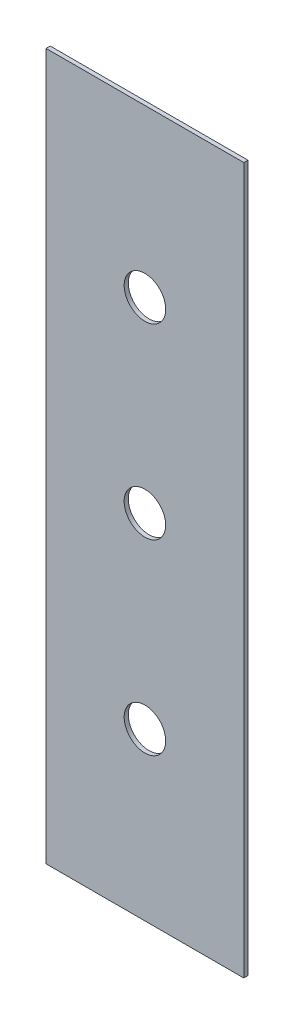
ISO-10303-21;
HEADER;
FILE_DESCRIPTION(('STEP AP214'),'2;1');
FILE_NAME('part.step','',(''),(''),'','','');
FILE_SCHEMA(('AUTOMOTIVE_DESIGN { 1 0 10303 214 1 1 1 1 }'));
ENDSEC;
DATA;
#1=APPLICATION_CONTEXT('core data for automotive mechanical design processes');
#2=APPLICATION_PROTOCOL_DEFINITION('international standard','automotive_design',2000,#1);
#3=PRODUCT_CONTEXT('',#1,'mechanical');
#4=PRODUCT('Part','Part','',(#3));
#5=PRODUCT_RELATED_PRODUCT_CATEGORY('part','',(#4));
#6=PRODUCT_DEFINITION_FORMATION('','',#4);
#7=PRODUCT_DEFINITION_CONTEXT('part definition',#1,'design');
#8=PRODUCT_DEFINITION('design','',#6,#7);
#9=PRODUCT_DEFINITION_SHAPE('','',#8);
#10=(LENGTH_UNIT() NAMED_UNIT(*) SI_UNIT(.MILLI.,.METRE.));
#11=(NAMED_UNIT(*) PLANE_ANGLE_UNIT() SI_UNIT($,.RADIAN.));
#12=(NAMED_UNIT(*) SI_UNIT($,.STERADIAN.) SOLID_ANGLE_UNIT());
#13=UNCERTAINTY_MEASURE_WITH_UNIT(LENGTH_MEASURE(1.E-05),#10,'distance_accuracy_value','');
#14=(GEOMETRIC_REPRESENTATION_CONTEXT(3) GLOBAL_UNCERTAINTY_ASSIGNED_CONTEXT((#13)) GLOBAL_UNIT_ASSIGNED_CONTEXT((#10,
#11,#12)) REPRESENTATION_CONTEXT('',''));
#15=CARTESIAN_POINT('',(0.,0.,0.));
#16=DIRECTION('',(0.,0.,1.));
#17=DIRECTION('',(1.,0.,0.));
#18=AXIS2_PLACEMENT_3D('',#15,#16,#17);
#19=CARTESIAN_POINT('',(0.,0.,1.));
#20=DIRECTION('',(0.,0.,-1.));
#21=DIRECTION('',(-1.,0.,0.));
#22=AXIS2_PLACEMENT_3D('',#19,#20,#21);
#23=PLANE('',#22);
#24=DIRECTION('',(0.,1.,0.));
#25=VECTOR('',#24,1.);
#26=CARTESIAN_POINT('',(299.637427607692,205.000000000005,1.));
#27=LINE('',#26,#25);
#28=CARTESIAN_POINT('',(299.637427607692,35.0000000000046,1.));
#29=VERTEX_POINT('',#28);
#30=CARTESIAN_POINT('',(299.637427607692,205.000000000005,1.));
#31=VERTEX_POINT('',#30);
#32=EDGE_CURVE('E89',#29,#31,#27,.T.);
#33=ORIENTED_EDGE('',*,*,#32,.T.);
#34=DIRECTION('',(-1.,0.,0.));
#35=VECTOR('',#34,1.);
#36=CARTESIAN_POINT('',(252.046776232743,205.000000000005,1.));
#37=LINE('',#36,#35);
#38=CARTESIAN_POINT('',(252.046776232743,205.000000000005,1.));
#39=VERTEX_POINT('',#38);
#40=EDGE_CURVE('E84',#31,#39,#37,.T.);
#41=ORIENTED_EDGE('',*,*,#40,.T.);
#42=DIRECTION('',(0.,-1.,0.));
#43=VECTOR('',#42,1.);
#44=CARTESIAN_POINT('',(252.046776232743,35.0000000000046,1.));
#45=LINE('',#44,#43);
#46=CARTESIAN_POINT('',(252.046776232743,35.0000000000046,1.));
#47=VERTEX_POINT('',#46);
#48=EDGE_CURVE('E87',#39,#47,#45,.T.);
#49=ORIENTED_EDGE('',*,*,#48,.T.);
#50=DIRECTION('',(1.,0.,0.));
#51=VECTOR('',#50,1.);
#52=CARTESIAN_POINT('',(299.637427607692,35.0000000000046,1.));
#53=LINE('',#52,#51);
#54=EDGE_CURVE('E54',#47,#29,#53,.T.);
#55=ORIENTED_EDGE('',*,*,#54,.T.);
#56=EDGE_LOOP('',(#33,#41,#49,#55));
#57=FACE_BOUND('',#56,.T.);
#58=CARTESIAN_POINT('',(275.842101920218,165.000000000005,1.));
#59=DIRECTION('',(0.,0.,1.));
#60=DIRECTION('',(1.,0.,0.));
#61=AXIS2_PLACEMENT_3D('',#58,#59,#60);
#62=CIRCLE('',#61,4.99999999999999);
#63=CARTESIAN_POINT('',(280.842101920218,165.000000000005,1.));
#64=VERTEX_POINT('',#63);
#65=EDGE_CURVE('E104',#64,#64,#62,.T.);
#66=ORIENTED_EDGE('',*,*,#65,.F.);
#67=EDGE_LOOP('',(#66));
#68=FACE_BOUND('',#67,.T.);
#69=CARTESIAN_POINT('',(275.842101920218,75.0000000000046,1.));
#70=DIRECTION('',(0.,0.,1.));
#71=DIRECTION('',(1.,0.,0.));
#72=AXIS2_PLACEMENT_3D('',#69,#70,#71);
#73=CIRCLE('',#72,4.99999999999999);
#74=CARTESIAN_POINT('',(280.842101920218,75.0000000000046,1.));
#75=VERTEX_POINT('',#74);
#76=EDGE_CURVE('E119',#75,#75,#73,.T.);
#77=ORIENTED_EDGE('',*,*,#76,.F.);
#78=EDGE_LOOP('',(#77));
#79=FACE_BOUND('',#78,.T.);
#80=CARTESIAN_POINT('',(275.842101920218,120.000000000005,1.));
#81=DIRECTION('',(0.,0.,1.));
#82=DIRECTION('',(1.,0.,0.));
#83=AXIS2_PLACEMENT_3D('',#80,#81,#82);
#84=CIRCLE('',#83,4.99999999999999);
#85=CARTESIAN_POINT('',(280.842101920218,120.000000000005,1.));
#86=VERTEX_POINT('',#85);
#87=EDGE_CURVE('E125',#86,#86,#84,.T.);
#88=ORIENTED_EDGE('',*,*,#87,.F.);
#89=EDGE_LOOP('',(#88));
#90=FACE_BOUND('',#89,.T.);
#91=ADVANCED_FACE('F37',(#57,#68,#79,#90),#23,.F.);
#92=CARTESIAN_POINT('',(0.,0.,0.));
#93=DIRECTION('',(0.,0.,-1.));
#94=DIRECTION('',(-1.,0.,0.));
#95=AXIS2_PLACEMENT_3D('',#92,#93,#94);
#96=PLANE('',#95);
#97=CARTESIAN_POINT('',(275.842101920218,75.0000000000046,0.));
#98=DIRECTION('',(0.,0.,1.));
#99=DIRECTION('',(1.,0.,0.));
#100=AXIS2_PLACEMENT_3D('',#97,#98,#99);
#101=CIRCLE('',#100,4.99999999999999);
#102=CARTESIAN_POINT('',(280.842101920218,75.0000000000046,0.));
#103=VERTEX_POINT('',#102);
#104=EDGE_CURVE('E122',#103,#103,#101,.T.);
#105=ORIENTED_EDGE('',*,*,#104,.T.);
#106=EDGE_LOOP('',(#105));
#107=FACE_BOUND('',#106,.T.);
#108=DIRECTION('',(0.,1.,0.));
#109=VECTOR('',#108,1.);
#110=CARTESIAN_POINT('',(299.637427607692,205.000000000005,0.));
#111=LINE('',#110,#109);
#112=CARTESIAN_POINT('',(299.637427607692,35.0000000000046,0.));
#113=VERTEX_POINT('',#112);
#114=CARTESIAN_POINT('',(299.637427607692,205.000000000005,0.));
#115=VERTEX_POINT('',#114);
#116=EDGE_CURVE('E101',#113,#115,#111,.T.);
#117=ORIENTED_EDGE('',*,*,#116,.F.);
#118=DIRECTION('',(1.,0.,0.));
#119=VECTOR('',#118,1.);
#120=CARTESIAN_POINT('',(299.637427607692,35.0000000000046,0.));
#121=LINE('',#120,#119);
#122=CARTESIAN_POINT('',(252.046776232743,35.0000000000046,0.));
#123=VERTEX_POINT('',#122);
#124=EDGE_CURVE('E77',#123,#113,#121,.T.);
#125=ORIENTED_EDGE('',*,*,#124,.F.);
#126=DIRECTION('',(0.,-1.,0.));
#127=VECTOR('',#126,1.);
#128=CARTESIAN_POINT('',(252.046776232743,35.0000000000046,0.));
#129=LINE('',#128,#127);
#130=CARTESIAN_POINT('',(252.046776232743,205.000000000005,0.));
#131=VERTEX_POINT('',#130);
#132=EDGE_CURVE('E71',#131,#123,#129,.T.);
#133=ORIENTED_EDGE('',*,*,#132,.F.);
#134=DIRECTION('',(-1.,0.,0.));
#135=VECTOR('',#134,1.);
#136=CARTESIAN_POINT('',(252.046776232743,205.000000000005,0.));
#137=LINE('',#136,#135);
#138=EDGE_CURVE('E93',#115,#131,#137,.T.);
#139=ORIENTED_EDGE('',*,*,#138,.F.);
#140=EDGE_LOOP('',(#117,#125,#133,#139));
#141=FACE_BOUND('',#140,.T.);
#142=CARTESIAN_POINT('',(275.842101920218,165.000000000005,0.));
#143=DIRECTION('',(0.,0.,1.));
#144=DIRECTION('',(1.,0.,0.));
#145=AXIS2_PLACEMENT_3D('',#142,#143,#144);
#146=CIRCLE('',#145,4.99999999999999);
#147=CARTESIAN_POINT('',(280.842101920218,165.000000000005,0.));
#148=VERTEX_POINT('',#147);
#149=EDGE_CURVE('E116',#148,#148,#146,.T.);
#150=ORIENTED_EDGE('',*,*,#149,.T.);
#151=EDGE_LOOP('',(#150));
#152=FACE_BOUND('',#151,.T.);
#153=CARTESIAN_POINT('',(275.842101920218,120.000000000005,0.));
#154=DIRECTION('',(0.,0.,1.));
#155=DIRECTION('',(1.,0.,0.));
#156=AXIS2_PLACEMENT_3D('',#153,#154,#155);
#157=CIRCLE('',#156,4.99999999999999);
#158=CARTESIAN_POINT('',(280.842101920218,120.000000000005,0.));
#159=VERTEX_POINT('',#158);
#160=EDGE_CURVE('E128',#159,#159,#157,.T.);
#161=ORIENTED_EDGE('',*,*,#160,.T.);
#162=EDGE_LOOP('',(#161));
#163=FACE_BOUND('',#162,.T.);
#164=ADVANCED_FACE('F112',(#107,#141,#152,#163),#96,.T.);
#165=CARTESIAN_POINT('',(299.637427607692,205.000000000005,1.));
#166=DIRECTION('',(-1.,0.,0.));
#167=DIRECTION('',(0.,0.,1.));
#168=AXIS2_PLACEMENT_3D('',#165,#166,#167);
#169=PLANE('',#168);
#170=ORIENTED_EDGE('',*,*,#116,.T.);
#171=DIRECTION('',(0.,0.,-1.));
#172=VECTOR('',#171,1.);
#173=CARTESIAN_POINT('',(299.637427607692,205.000000000005,1.));
#174=LINE('',#173,#172);
#175=EDGE_CURVE('E11',#31,#115,#174,.T.);
#176=ORIENTED_EDGE('',*,*,#175,.F.);
#177=ORIENTED_EDGE('',*,*,#32,.F.);
#178=DIRECTION('',(0.,0.,-1.));
#179=VECTOR('',#178,1.);
#180=CARTESIAN_POINT('',(299.637427607692,35.0000000000046,1.));
#181=LINE('',#180,#179);
#182=EDGE_CURVE('E97',#29,#113,#181,.T.);
#183=ORIENTED_EDGE('',*,*,#182,.T.);
#184=EDGE_LOOP('',(#170,#176,#177,#183));
#185=FACE_BOUND('',#184,.T.);
#186=ADVANCED_FACE('F39',(#185),#169,.F.);
#187=CARTESIAN_POINT('',(252.046776232743,205.000000000005,1.));
#188=DIRECTION('',(0.,-1.,0.));
#189=DIRECTION('',(0.,0.,-1.));
#190=AXIS2_PLACEMENT_3D('',#187,#188,#189);
#191=PLANE('',#190);
#192=ORIENTED_EDGE('',*,*,#138,.T.);
#193=DIRECTION('',(0.,0.,-1.));
#194=VECTOR('',#193,1.);
#195=CARTESIAN_POINT('',(252.046776232743,205.000000000005,1.));
#196=LINE('',#195,#194);
#197=EDGE_CURVE('E46',#39,#131,#196,.T.);
#198=ORIENTED_EDGE('',*,*,#197,.F.);
#199=ORIENTED_EDGE('',*,*,#40,.F.);
#200=ORIENTED_EDGE('',*,*,#175,.T.);
#201=EDGE_LOOP('',(#192,#198,#199,#200));
#202=FACE_BOUND('',#201,.T.);
#203=ADVANCED_FACE('F92',(#202),#191,.F.);
#204=CARTESIAN_POINT('',(252.046776232743,35.0000000000046,1.));
#205=DIRECTION('',(1.,0.,0.));
#206=DIRECTION('',(0.,0.,-1.));
#207=AXIS2_PLACEMENT_3D('',#204,#205,#206);
#208=PLANE('',#207);
#209=ORIENTED_EDGE('',*,*,#132,.T.);
#210=DIRECTION('',(0.,0.,-1.));
#211=VECTOR('',#210,1.);
#212=CARTESIAN_POINT('',(252.046776232743,35.0000000000046,1.));
#213=LINE('',#212,#211);
#214=EDGE_CURVE('E94',#47,#123,#213,.T.);
#215=ORIENTED_EDGE('',*,*,#214,.F.);
#216=ORIENTED_EDGE('',*,*,#48,.F.);
#217=ORIENTED_EDGE('',*,*,#197,.T.);
#218=EDGE_LOOP('',(#209,#215,#216,#217));
#219=FACE_BOUND('',#218,.T.);
#220=ADVANCED_FACE('F95',(#219),#208,.F.);
#221=CARTESIAN_POINT('',(299.637427607692,35.0000000000046,1.));
#222=DIRECTION('',(0.,1.,0.));
#223=DIRECTION('',(0.,0.,1.));
#224=AXIS2_PLACEMENT_3D('',#221,#222,#223);
#225=PLANE('',#224);
#226=ORIENTED_EDGE('',*,*,#124,.T.);
#227=ORIENTED_EDGE('',*,*,#182,.F.);
#228=ORIENTED_EDGE('',*,*,#54,.F.);
#229=ORIENTED_EDGE('',*,*,#214,.T.);
#230=EDGE_LOOP('',(#226,#227,#228,#229));
#231=FACE_BOUND('',#230,.T.);
#232=ADVANCED_FACE('F109',(#231),#225,.F.);
#233=CARTESIAN_POINT('',(275.842101920218,165.000000000005,1.));
#234=DIRECTION('',(0.,0.,-1.));
#235=DIRECTION('',(-1.,0.,0.));
#236=AXIS2_PLACEMENT_3D('',#233,#234,#235);
#237=CYLINDRICAL_SURFACE('',#236,4.99999999999999);
#238=ORIENTED_EDGE('',*,*,#65,.T.);
#239=EDGE_LOOP('',(#238));
#240=FACE_BOUND('',#239,.T.);
#241=ORIENTED_EDGE('',*,*,#149,.F.);
#242=EDGE_LOOP('',(#241));
#243=FACE_BOUND('',#242,.T.);
#244=ADVANCED_FACE('F145',(#240,#243),#237,.F.);
#245=CARTESIAN_POINT('',(275.842101920218,75.0000000000046,1.));
#246=DIRECTION('',(0.,0.,-1.));
#247=DIRECTION('',(-1.,0.,0.));
#248=AXIS2_PLACEMENT_3D('',#245,#246,#247);
#249=CYLINDRICAL_SURFACE('',#248,4.99999999999999);
#250=ORIENTED_EDGE('',*,*,#76,.T.);
#251=EDGE_LOOP('',(#250));
#252=FACE_BOUND('',#251,.T.);
#253=ORIENTED_EDGE('',*,*,#104,.F.);
#254=EDGE_LOOP('',(#253));
#255=FACE_BOUND('',#254,.T.);
#256=ADVANCED_FACE('F199',(#252,#255),#249,.F.);
#257=CARTESIAN_POINT('',(275.842101920218,120.000000000005,1.));
#258=DIRECTION('',(0.,0.,-1.));
#259=DIRECTION('',(-1.,0.,0.));
#260=AXIS2_PLACEMENT_3D('',#257,#258,#259);
#261=CYLINDRICAL_SURFACE('',#260,4.99999999999999);
#262=ORIENTED_EDGE('',*,*,#87,.T.);
#263=EDGE_LOOP('',(#262));
#264=FACE_BOUND('',#263,.T.);
#265=ORIENTED_EDGE('',*,*,#160,.F.);
#266=EDGE_LOOP('',(#265));
#267=FACE_BOUND('',#266,.T.);
#268=ADVANCED_FACE('F134',(#264,#267),#261,.F.);
#269=CLOSED_SHELL('',(#91,#164,#186,#203,#220,#232,#244,#256,#268));
#270=MANIFOLD_SOLID_BREP('B2',#269);
#271=ADVANCED_BREP_SHAPE_REPRESENTATION('',(#18,#270),#14);
#272=SHAPE_DEFINITION_REPRESENTATION(#9,#271);
ENDSEC;
END-ISO-10303-21;
